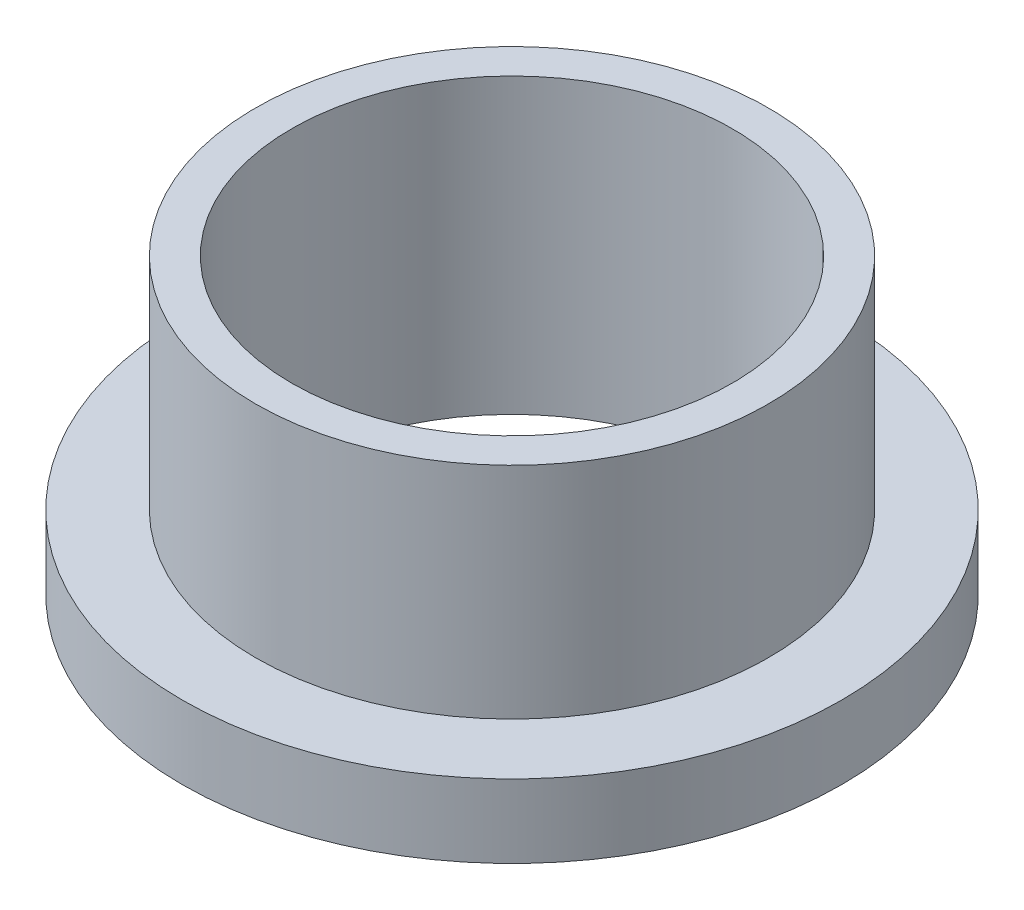
ISO-10303-21;
HEADER;
FILE_DESCRIPTION(('STEP AP214'),'2;1');
FILE_NAME('part.step','',(''),(''),'','','');
FILE_SCHEMA(('AUTOMOTIVE_DESIGN { 1 0 10303 214 1 1 1 1 }'));
ENDSEC;
DATA;
#1=APPLICATION_CONTEXT('core data for automotive mechanical design processes');
#2=APPLICATION_PROTOCOL_DEFINITION('international standard','automotive_design',2000,#1);
#3=PRODUCT_CONTEXT('',#1,'mechanical');
#4=PRODUCT('Part','Part','',(#3));
#5=PRODUCT_RELATED_PRODUCT_CATEGORY('part','',(#4));
#6=PRODUCT_DEFINITION_FORMATION('','',#4);
#7=PRODUCT_DEFINITION_CONTEXT('part definition',#1,'design');
#8=PRODUCT_DEFINITION('design','',#6,#7);
#9=PRODUCT_DEFINITION_SHAPE('','',#8);
#10=(LENGTH_UNIT() NAMED_UNIT(*) SI_UNIT(.MILLI.,.METRE.));
#11=(NAMED_UNIT(*) PLANE_ANGLE_UNIT() SI_UNIT($,.RADIAN.));
#12=(NAMED_UNIT(*) SI_UNIT($,.STERADIAN.) SOLID_ANGLE_UNIT());
#13=UNCERTAINTY_MEASURE_WITH_UNIT(LENGTH_MEASURE(1.E-05),#10,'distance_accuracy_value','');
#14=(GEOMETRIC_REPRESENTATION_CONTEXT(3) GLOBAL_UNCERTAINTY_ASSIGNED_CONTEXT((#13)) GLOBAL_UNIT_ASSIGNED_CONTEXT((#10,
#11,#12)) REPRESENTATION_CONTEXT('',''));
#15=CARTESIAN_POINT('',(0.,0.,0.));
#16=DIRECTION('',(0.,0.,1.));
#17=DIRECTION('',(1.,0.,0.));
#18=AXIS2_PLACEMENT_3D('',#15,#16,#17);
#19=CARTESIAN_POINT('',(0.,12.7,0.));
#20=DIRECTION('',(0.,1.,0.));
#21=DIRECTION('',(0.,0.,1.));
#22=AXIS2_PLACEMENT_3D('',#19,#20,#21);
#23=PLANE('',#22);
#24=CARTESIAN_POINT('',(0.,12.7,0.));
#25=DIRECTION('',(0.,1.,0.));
#26=DIRECTION('',(0.,0.,1.));
#27=AXIS2_PLACEMENT_3D('',#24,#25,#26);
#28=CIRCLE('',#27,11.1125);
#29=CARTESIAN_POINT('',(0.,12.7,11.1125));
#30=VERTEX_POINT('',#29);
#31=EDGE_CURVE('E10',#30,#30,#28,.T.);
#32=ORIENTED_EDGE('',*,*,#31,.T.);
#33=EDGE_LOOP('',(#32));
#34=FACE_BOUND('',#33,.T.);
#35=CARTESIAN_POINT('',(0.,12.7,0.));
#36=DIRECTION('',(0.,1.,0.));
#37=DIRECTION('',(0.,0.,1.));
#38=AXIS2_PLACEMENT_3D('',#35,#36,#37);
#39=CIRCLE('',#38,9.5504);
#40=CARTESIAN_POINT('',(0.,12.7,9.5504));
#41=VERTEX_POINT('',#40);
#42=EDGE_CURVE('E37',#41,#41,#39,.T.);
#43=ORIENTED_EDGE('',*,*,#42,.F.);
#44=EDGE_LOOP('',(#43));
#45=FACE_BOUND('',#44,.T.);
#46=ADVANCED_FACE('F30',(#34,#45),#23,.T.);
#47=CARTESIAN_POINT('',(0.,0.,0.));
#48=DIRECTION('',(0.,1.,0.));
#49=DIRECTION('',(0.,0.,1.));
#50=AXIS2_PLACEMENT_3D('',#47,#48,#49);
#51=PLANE('',#50);
#52=CARTESIAN_POINT('',(0.,0.,0.));
#53=DIRECTION('',(0.,1.,0.));
#54=DIRECTION('',(0.,0.,1.));
#55=AXIS2_PLACEMENT_3D('',#52,#53,#54);
#56=CIRCLE('',#55,9.5504);
#57=CARTESIAN_POINT('',(0.,0.,9.5504));
#58=VERTEX_POINT('',#57);
#59=EDGE_CURVE('E41',#58,#58,#56,.T.);
#60=ORIENTED_EDGE('',*,*,#59,.T.);
#61=EDGE_LOOP('',(#60));
#62=FACE_BOUND('',#61,.T.);
#63=CARTESIAN_POINT('',(0.,0.,0.));
#64=DIRECTION('',(0.,1.,0.));
#65=DIRECTION('',(0.,0.,1.));
#66=AXIS2_PLACEMENT_3D('',#63,#64,#65);
#67=CIRCLE('',#66,14.2875);
#68=CARTESIAN_POINT('',(0.,0.,14.2875));
#69=VERTEX_POINT('',#68);
#70=EDGE_CURVE('E48',#69,#69,#67,.T.);
#71=ORIENTED_EDGE('',*,*,#70,.F.);
#72=EDGE_LOOP('',(#71));
#73=FACE_BOUND('',#72,.T.);
#74=ADVANCED_FACE('F73',(#62,#73),#51,.F.);
#75=CARTESIAN_POINT('',(0.,12.7,0.));
#76=DIRECTION('',(0.,-1.,0.));
#77=DIRECTION('',(0.,0.,-1.));
#78=AXIS2_PLACEMENT_3D('',#75,#76,#77);
#79=CYLINDRICAL_SURFACE('',#78,11.1125);
#80=CARTESIAN_POINT('',(0.,3.175,0.));
#81=DIRECTION('',(0.,1.,0.));
#82=DIRECTION('',(0.,0.,1.));
#83=AXIS2_PLACEMENT_3D('',#80,#81,#82);
#84=CIRCLE('',#83,11.1125);
#85=CARTESIAN_POINT('',(0.,3.175,11.1125));
#86=VERTEX_POINT('',#85);
#87=EDGE_CURVE('E51',#86,#86,#84,.T.);
#88=ORIENTED_EDGE('',*,*,#87,.T.);
#89=EDGE_LOOP('',(#88));
#90=FACE_BOUND('',#89,.T.);
#91=ORIENTED_EDGE('',*,*,#31,.F.);
#92=EDGE_LOOP('',(#91));
#93=FACE_BOUND('',#92,.T.);
#94=ADVANCED_FACE('F32',(#90,#93),#79,.T.);
#95=CARTESIAN_POINT('',(0.,12.7,0.));
#96=DIRECTION('',(0.,-1.,0.));
#97=DIRECTION('',(0.,0.,-1.));
#98=AXIS2_PLACEMENT_3D('',#95,#96,#97);
#99=CYLINDRICAL_SURFACE('',#98,9.5504);
#100=ORIENTED_EDGE('',*,*,#42,.T.);
#101=EDGE_LOOP('',(#100));
#102=FACE_BOUND('',#101,.T.);
#103=ORIENTED_EDGE('',*,*,#59,.F.);
#104=EDGE_LOOP('',(#103));
#105=FACE_BOUND('',#104,.T.);
#106=ADVANCED_FACE('F62',(#102,#105),#99,.F.);
#107=CARTESIAN_POINT('',(0.,3.175,0.));
#108=DIRECTION('',(0.,1.,0.));
#109=DIRECTION('',(0.,0.,1.));
#110=AXIS2_PLACEMENT_3D('',#107,#108,#109);
#111=PLANE('',#110);
#112=CARTESIAN_POINT('',(0.,3.175,0.));
#113=DIRECTION('',(0.,1.,0.));
#114=DIRECTION('',(0.,0.,1.));
#115=AXIS2_PLACEMENT_3D('',#112,#113,#114);
#116=CIRCLE('',#115,14.2875);
#117=CARTESIAN_POINT('',(0.,3.175,14.2875));
#118=VERTEX_POINT('',#117);
#119=EDGE_CURVE('E46',#118,#118,#116,.T.);
#120=ORIENTED_EDGE('',*,*,#119,.T.);
#121=EDGE_LOOP('',(#120));
#122=FACE_BOUND('',#121,.T.);
#123=ORIENTED_EDGE('',*,*,#87,.F.);
#124=EDGE_LOOP('',(#123));
#125=FACE_BOUND('',#124,.T.);
#126=ADVANCED_FACE('F59',(#122,#125),#111,.T.);
#127=CARTESIAN_POINT('',(0.,3.175,0.));
#128=DIRECTION('',(0.,-1.,0.));
#129=DIRECTION('',(0.,0.,-1.));
#130=AXIS2_PLACEMENT_3D('',#127,#128,#129);
#131=CYLINDRICAL_SURFACE('',#130,14.2875);
#132=ORIENTED_EDGE('',*,*,#119,.F.);
#133=EDGE_LOOP('',(#132));
#134=FACE_BOUND('',#133,.T.);
#135=ORIENTED_EDGE('',*,*,#70,.T.);
#136=EDGE_LOOP('',(#135));
#137=FACE_BOUND('',#136,.T.);
#138=ADVANCED_FACE('F61',(#134,#137),#131,.T.);
#139=CLOSED_SHELL('',(#46,#74,#94,#106,#126,#138));
#140=MANIFOLD_SOLID_BREP('B2',#139);
#141=ADVANCED_BREP_SHAPE_REPRESENTATION('',(#18,#140),#14);
#142=SHAPE_DEFINITION_REPRESENTATION(#9,#141);
ENDSEC;
END-ISO-10303-21;
